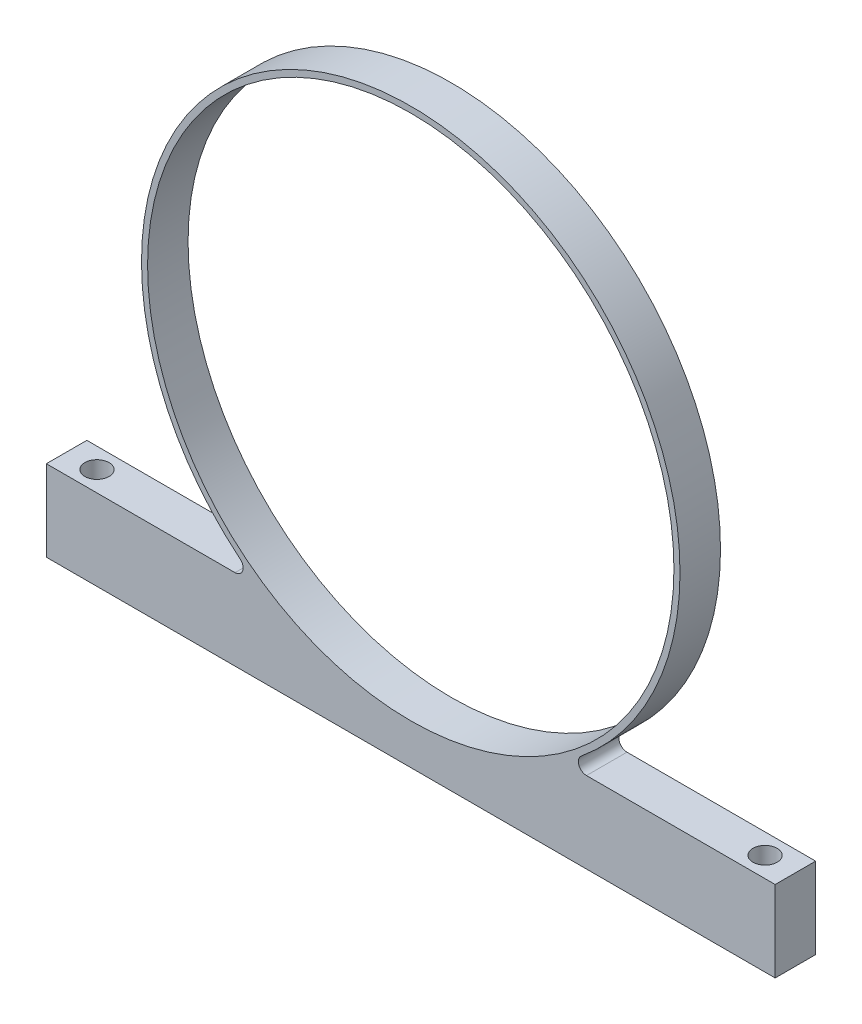
ISO-10303-21;
HEADER;
FILE_DESCRIPTION(('STEP AP214'),'2;1');
FILE_NAME('part.step','',(''),(''),'','','');
FILE_SCHEMA(('AUTOMOTIVE_DESIGN { 1 0 10303 214 1 1 1 1 }'));
ENDSEC;
DATA;
#1=APPLICATION_CONTEXT('core data for automotive mechanical design processes');
#2=APPLICATION_PROTOCOL_DEFINITION('international standard','automotive_design',2000,#1);
#3=PRODUCT_CONTEXT('',#1,'mechanical');
#4=PRODUCT('Part','Part','',(#3));
#5=PRODUCT_RELATED_PRODUCT_CATEGORY('part','',(#4));
#6=PRODUCT_DEFINITION_FORMATION('','',#4);
#7=PRODUCT_DEFINITION_CONTEXT('part definition',#1,'design');
#8=PRODUCT_DEFINITION('design','',#6,#7);
#9=PRODUCT_DEFINITION_SHAPE('','',#8);
#10=(LENGTH_UNIT() NAMED_UNIT(*) SI_UNIT(.MILLI.,.METRE.));
#11=(NAMED_UNIT(*) PLANE_ANGLE_UNIT() SI_UNIT($,.RADIAN.));
#12=(NAMED_UNIT(*) SI_UNIT($,.STERADIAN.) SOLID_ANGLE_UNIT());
#13=UNCERTAINTY_MEASURE_WITH_UNIT(LENGTH_MEASURE(1.E-05),#10,'distance_accuracy_value','');
#14=(GEOMETRIC_REPRESENTATION_CONTEXT(3) GLOBAL_UNCERTAINTY_ASSIGNED_CONTEXT((#13)) GLOBAL_UNIT_ASSIGNED_CONTEXT((#10,
#11,#12)) REPRESENTATION_CONTEXT('',''));
#15=CARTESIAN_POINT('',(0.,0.,0.));
#16=DIRECTION('',(0.,0.,1.));
#17=DIRECTION('',(1.,0.,0.));
#18=AXIS2_PLACEMENT_3D('',#15,#16,#17);
#19=CARTESIAN_POINT('',(0.,0.,6.35));
#20=DIRECTION('',(0.,0.,1.));
#21=DIRECTION('',(1.,0.,0.));
#22=AXIS2_PLACEMENT_3D('',#19,#20,#21);
#23=PLANE('',#22);
#24=DIRECTION('',(0.,-1.,0.));
#25=VECTOR('',#24,1.);
#26=CARTESIAN_POINT('',(-57.15,-34.925,6.35));
#27=LINE('',#26,#25);
#28=CARTESIAN_POINT('',(-57.15,-34.925,6.35));
#29=VERTEX_POINT('',#28);
#30=CARTESIAN_POINT('',(-57.15,-47.625,6.35));
#31=VERTEX_POINT('',#30);
#32=EDGE_CURVE('E108',#29,#31,#27,.T.);
#33=ORIENTED_EDGE('',*,*,#32,.T.);
#34=DIRECTION('',(1.,0.,0.));
#35=VECTOR('',#34,1.);
#36=CARTESIAN_POINT('',(57.15,-47.625,6.35));
#37=LINE('',#36,#35);
#38=CARTESIAN_POINT('',(57.15,-47.625,6.35));
#39=VERTEX_POINT('',#38);
#40=EDGE_CURVE('E97',#31,#39,#37,.T.);
#41=ORIENTED_EDGE('',*,*,#40,.T.);
#42=DIRECTION('',(0.,1.,0.));
#43=VECTOR('',#42,1.);
#44=CARTESIAN_POINT('',(57.15,-34.925,6.35));
#45=LINE('',#44,#43);
#46=CARTESIAN_POINT('',(57.15,-34.925,6.35));
#47=VERTEX_POINT('',#46);
#48=EDGE_CURVE('E107',#39,#47,#45,.T.);
#49=ORIENTED_EDGE('',*,*,#48,.T.);
#50=DIRECTION('',(-1.,0.,0.));
#51=VECTOR('',#50,1.);
#52=CARTESIAN_POINT('',(57.15,-34.925,6.35));
#53=LINE('',#52,#51);
#54=CARTESIAN_POINT('',(27.5567320495374,-34.925,6.35));
#55=VERTEX_POINT('',#54);
#56=EDGE_CURVE('E169',#47,#55,#53,.T.);
#57=ORIENTED_EDGE('',*,*,#56,.T.);
#58=CARTESIAN_POINT('',(27.5567320495374,-33.655,6.35));
#59=DIRECTION('',(0.,0.,1.));
#60=DIRECTION('',(1.,0.,0.));
#61=AXIS2_PLACEMENT_3D('',#58,#59,#60);
#62=CIRCLE('',#61,1.27);
#63=CARTESIAN_POINT('',(26.7521559313027,-32.6723722627737,6.35));
#64=VERTEX_POINT('',#63);
#65=EDGE_CURVE('E11',#55,#64,#62,.F.);
#66=ORIENTED_EDGE('',*,*,#65,.T.);
#67=CARTESIAN_POINT('',(0.,0.,6.35));
#68=DIRECTION('',(0.,0.,1.));
#69=DIRECTION('',(1.,0.,0.));
#70=AXIS2_PLACEMENT_3D('',#67,#68,#69);
#71=CIRCLE('',#70,42.2275);
#72=CARTESIAN_POINT('',(-26.7521559313027,-32.6723722627737,6.35));
#73=VERTEX_POINT('',#72);
#74=EDGE_CURVE('E142',#64,#73,#71,.T.);
#75=ORIENTED_EDGE('',*,*,#74,.T.);
#76=CARTESIAN_POINT('',(-27.5567320495374,-33.655,6.35));
#77=DIRECTION('',(0.,0.,1.));
#78=DIRECTION('',(1.,0.,0.));
#79=AXIS2_PLACEMENT_3D('',#76,#77,#78);
#80=CIRCLE('',#79,1.27);
#81=CARTESIAN_POINT('',(-27.5567320495374,-34.925,6.35));
#82=VERTEX_POINT('',#81);
#83=EDGE_CURVE('E138',#73,#82,#80,.F.);
#84=ORIENTED_EDGE('',*,*,#83,.T.);
#85=DIRECTION('',(-1.,0.,0.));
#86=VECTOR('',#85,1.);
#87=CARTESIAN_POINT('',(-23.7361776882884,-34.925,6.35));
#88=LINE('',#87,#86);
#89=EDGE_CURVE('E113',#82,#29,#88,.T.);
#90=ORIENTED_EDGE('',*,*,#89,.T.);
#91=EDGE_LOOP('',(#33,#41,#49,#57,#66,#75,#84,#90));
#92=FACE_BOUND('',#91,.T.);
#93=CARTESIAN_POINT('',(0.,0.,6.35));
#94=DIRECTION('',(0.,0.,1.));
#95=DIRECTION('',(1.,0.,0.));
#96=AXIS2_PLACEMENT_3D('',#93,#94,#95);
#97=CIRCLE('',#96,41.275);
#98=CARTESIAN_POINT('',(41.275,0.,6.35));
#99=VERTEX_POINT('',#98);
#100=EDGE_CURVE('E175',#99,#99,#97,.T.);
#101=ORIENTED_EDGE('',*,*,#100,.F.);
#102=EDGE_LOOP('',(#101));
#103=FACE_BOUND('',#102,.T.);
#104=ADVANCED_FACE('F32',(#92,#103),#23,.T.);
#105=CARTESIAN_POINT('',(0.,0.,0.));
#106=DIRECTION('',(0.,0.,1.));
#107=DIRECTION('',(1.,0.,0.));
#108=AXIS2_PLACEMENT_3D('',#105,#106,#107);
#109=PLANE('',#108);
#110=DIRECTION('',(0.,-1.,0.));
#111=VECTOR('',#110,1.);
#112=CARTESIAN_POINT('',(-57.15,-34.925,0.));
#113=LINE('',#112,#111);
#114=CARTESIAN_POINT('',(-57.15,-34.925,0.));
#115=VERTEX_POINT('',#114);
#116=CARTESIAN_POINT('',(-57.15,-47.625,0.));
#117=VERTEX_POINT('',#116);
#118=EDGE_CURVE('E121',#115,#117,#113,.T.);
#119=ORIENTED_EDGE('',*,*,#118,.F.);
#120=DIRECTION('',(-1.,0.,0.));
#121=VECTOR('',#120,1.);
#122=CARTESIAN_POINT('',(-23.7361776882884,-34.925,0.));
#123=LINE('',#122,#121);
#124=CARTESIAN_POINT('',(-27.5567320495374,-34.925,0.));
#125=VERTEX_POINT('',#124);
#126=EDGE_CURVE('E117',#125,#115,#123,.T.);
#127=ORIENTED_EDGE('',*,*,#126,.F.);
#128=CARTESIAN_POINT('',(-27.5567320495374,-33.655,0.));
#129=DIRECTION('',(0.,0.,1.));
#130=DIRECTION('',(1.,0.,0.));
#131=AXIS2_PLACEMENT_3D('',#128,#129,#130);
#132=CIRCLE('',#131,1.27);
#133=CARTESIAN_POINT('',(-26.7521559313027,-32.6723722627737,0.));
#134=VERTEX_POINT('',#133);
#135=EDGE_CURVE('E136',#125,#134,#132,.T.);
#136=ORIENTED_EDGE('',*,*,#135,.T.);
#137=CARTESIAN_POINT('',(0.,0.,0.));
#138=DIRECTION('',(0.,0.,1.));
#139=DIRECTION('',(1.,0.,0.));
#140=AXIS2_PLACEMENT_3D('',#137,#138,#139);
#141=CIRCLE('',#140,42.2275);
#142=CARTESIAN_POINT('',(26.7521559313027,-32.6723722627737,0.));
#143=VERTEX_POINT('',#142);
#144=EDGE_CURVE('E155',#143,#134,#141,.T.);
#145=ORIENTED_EDGE('',*,*,#144,.F.);
#146=CARTESIAN_POINT('',(27.5567320495374,-33.655,0.));
#147=DIRECTION('',(0.,0.,1.));
#148=DIRECTION('',(1.,0.,0.));
#149=AXIS2_PLACEMENT_3D('',#146,#147,#148);
#150=CIRCLE('',#149,1.27);
#151=CARTESIAN_POINT('',(27.5567320495374,-34.925,0.));
#152=VERTEX_POINT('',#151);
#153=EDGE_CURVE('E40',#143,#152,#150,.T.);
#154=ORIENTED_EDGE('',*,*,#153,.T.);
#155=DIRECTION('',(-1.,0.,0.));
#156=VECTOR('',#155,1.);
#157=CARTESIAN_POINT('',(57.15,-34.925,0.));
#158=LINE('',#157,#156);
#159=CARTESIAN_POINT('',(57.15,-34.925,0.));
#160=VERTEX_POINT('',#159);
#161=EDGE_CURVE('E159',#160,#152,#158,.T.);
#162=ORIENTED_EDGE('',*,*,#161,.F.);
#163=DIRECTION('',(0.,1.,0.));
#164=VECTOR('',#163,1.);
#165=CARTESIAN_POINT('',(57.15,-34.925,0.));
#166=LINE('',#165,#164);
#167=CARTESIAN_POINT('',(57.15,-47.625,0.));
#168=VERTEX_POINT('',#167);
#169=EDGE_CURVE('E162',#168,#160,#166,.T.);
#170=ORIENTED_EDGE('',*,*,#169,.F.);
#171=DIRECTION('',(1.,0.,0.));
#172=VECTOR('',#171,1.);
#173=CARTESIAN_POINT('',(57.15,-47.625,0.));
#174=LINE('',#173,#172);
#175=EDGE_CURVE('E172',#117,#168,#174,.T.);
#176=ORIENTED_EDGE('',*,*,#175,.F.);
#177=EDGE_LOOP('',(#119,#127,#136,#145,#154,#162,#170,#176));
#178=FACE_BOUND('',#177,.T.);
#179=CARTESIAN_POINT('',(0.,0.,0.));
#180=DIRECTION('',(0.,0.,1.));
#181=DIRECTION('',(1.,0.,0.));
#182=AXIS2_PLACEMENT_3D('',#179,#180,#181);
#183=CIRCLE('',#182,41.275);
#184=CARTESIAN_POINT('',(41.275,0.,0.));
#185=VERTEX_POINT('',#184);
#186=EDGE_CURVE('E180',#185,#185,#183,.T.);
#187=ORIENTED_EDGE('',*,*,#186,.T.);
#188=EDGE_LOOP('',(#187));
#189=FACE_BOUND('',#188,.T.);
#190=ADVANCED_FACE('F153',(#178,#189),#109,.F.);
#191=CARTESIAN_POINT('',(-57.15,-34.925,6.35));
#192=DIRECTION('',(1.,0.,0.));
#193=DIRECTION('',(0.,0.,-1.));
#194=AXIS2_PLACEMENT_3D('',#191,#192,#193);
#195=PLANE('',#194);
#196=ORIENTED_EDGE('',*,*,#118,.T.);
#197=DIRECTION('',(0.,0.,-1.));
#198=VECTOR('',#197,1.);
#199=CARTESIAN_POINT('',(-57.15,-47.625,6.35));
#200=LINE('',#199,#198);
#201=EDGE_CURVE('E101',#31,#117,#200,.T.);
#202=ORIENTED_EDGE('',*,*,#201,.F.);
#203=ORIENTED_EDGE('',*,*,#32,.F.);
#204=DIRECTION('',(0.,0.,-1.));
#205=VECTOR('',#204,1.);
#206=CARTESIAN_POINT('',(-57.15,-34.925,6.35));
#207=LINE('',#206,#205);
#208=EDGE_CURVE('E149',#29,#115,#207,.T.);
#209=ORIENTED_EDGE('',*,*,#208,.T.);
#210=EDGE_LOOP('',(#196,#202,#203,#209));
#211=FACE_BOUND('',#210,.T.);
#212=ADVANCED_FACE('F119',(#211),#195,.F.);
#213=CARTESIAN_POINT('',(57.15,-47.625,6.35));
#214=DIRECTION('',(0.,1.,0.));
#215=DIRECTION('',(-1.,0.,0.));
#216=AXIS2_PLACEMENT_3D('',#213,#214,#215);
#217=PLANE('',#216);
#218=CARTESIAN_POINT('',(-52.3875,-47.625,3.17499999999999));
#219=DIRECTION('',(0.,-1.,0.));
#220=DIRECTION('',(0.,0.,-1.));
#221=AXIS2_PLACEMENT_3D('',#218,#219,#220);
#222=CIRCLE('',#221,1.89864999999999);
#223=CARTESIAN_POINT('',(-52.3875,-47.625,1.27635));
#224=VERTEX_POINT('',#223);
#225=EDGE_CURVE('E194',#224,#224,#222,.T.);
#226=ORIENTED_EDGE('',*,*,#225,.F.);
#227=EDGE_LOOP('',(#226));
#228=FACE_BOUND('',#227,.T.);
#229=CARTESIAN_POINT('',(52.3875,-47.625,3.175));
#230=DIRECTION('',(0.,-1.,0.));
#231=DIRECTION('',(0.,0.,-1.));
#232=AXIS2_PLACEMENT_3D('',#229,#230,#231);
#233=CIRCLE('',#232,1.89864999999999);
#234=CARTESIAN_POINT('',(52.3875,-47.625,1.27635000000001));
#235=VERTEX_POINT('',#234);
#236=EDGE_CURVE('E188',#235,#235,#233,.T.);
#237=ORIENTED_EDGE('',*,*,#236,.F.);
#238=EDGE_LOOP('',(#237));
#239=FACE_BOUND('',#238,.T.);
#240=ORIENTED_EDGE('',*,*,#175,.T.);
#241=DIRECTION('',(0.,0.,-1.));
#242=VECTOR('',#241,1.);
#243=CARTESIAN_POINT('',(57.15,-47.625,6.35));
#244=LINE('',#243,#242);
#245=EDGE_CURVE('E104',#39,#168,#244,.T.);
#246=ORIENTED_EDGE('',*,*,#245,.F.);
#247=ORIENTED_EDGE('',*,*,#40,.F.);
#248=ORIENTED_EDGE('',*,*,#201,.T.);
#249=EDGE_LOOP('',(#240,#246,#247,#248));
#250=FACE_BOUND('',#249,.T.);
#251=ADVANCED_FACE('F99',(#228,#239,#250),#217,.F.);
#252=CARTESIAN_POINT('',(57.15,-34.925,6.35));
#253=DIRECTION('',(-1.,0.,0.));
#254=DIRECTION('',(0.,-1.,0.));
#255=AXIS2_PLACEMENT_3D('',#252,#253,#254);
#256=PLANE('',#255);
#257=ORIENTED_EDGE('',*,*,#169,.T.);
#258=DIRECTION('',(0.,0.,-1.));
#259=VECTOR('',#258,1.);
#260=CARTESIAN_POINT('',(57.15,-34.925,6.35));
#261=LINE('',#260,#259);
#262=EDGE_CURVE('E127',#47,#160,#261,.T.);
#263=ORIENTED_EDGE('',*,*,#262,.F.);
#264=ORIENTED_EDGE('',*,*,#48,.F.);
#265=ORIENTED_EDGE('',*,*,#245,.T.);
#266=EDGE_LOOP('',(#257,#263,#264,#265));
#267=FACE_BOUND('',#266,.T.);
#268=ADVANCED_FACE('F203',(#267),#256,.F.);
#269=CARTESIAN_POINT('',(57.15,-34.925,6.35));
#270=DIRECTION('',(0.,-1.,0.));
#271=DIRECTION('',(0.,0.,-1.));
#272=AXIS2_PLACEMENT_3D('',#269,#270,#271);
#273=PLANE('',#272);
#274=CARTESIAN_POINT('',(52.3875,-34.925,3.175));
#275=DIRECTION('',(0.,-1.,0.));
#276=DIRECTION('',(0.,0.,-1.));
#277=AXIS2_PLACEMENT_3D('',#274,#275,#276);
#278=CIRCLE('',#277,1.89864999999999);
#279=CARTESIAN_POINT('',(52.3875,-34.925,1.27635000000001));
#280=VERTEX_POINT('',#279);
#281=EDGE_CURVE('E183',#280,#280,#278,.T.);
#282=ORIENTED_EDGE('',*,*,#281,.T.);
#283=EDGE_LOOP('',(#282));
#284=FACE_BOUND('',#283,.T.);
#285=ORIENTED_EDGE('',*,*,#161,.T.);
#286=DIRECTION('',(0.,0.,1.));
#287=VECTOR('',#286,1.);
#288=CARTESIAN_POINT('',(27.5567320495374,-34.925,6.35));
#289=LINE('',#288,#287);
#290=EDGE_CURVE('E47',#152,#55,#289,.T.);
#291=ORIENTED_EDGE('',*,*,#290,.T.);
#292=ORIENTED_EDGE('',*,*,#56,.F.);
#293=ORIENTED_EDGE('',*,*,#262,.T.);
#294=EDGE_LOOP('',(#285,#291,#292,#293));
#295=FACE_BOUND('',#294,.T.);
#296=ADVANCED_FACE('F168',(#284,#295),#273,.F.);
#297=CARTESIAN_POINT('',(0.,0.,6.35));
#298=DIRECTION('',(0.,0.,-1.));
#299=DIRECTION('',(-1.,0.,0.));
#300=AXIS2_PLACEMENT_3D('',#297,#298,#299);
#301=CYLINDRICAL_SURFACE('',#300,42.2275);
#302=ORIENTED_EDGE('',*,*,#144,.T.);
#303=DIRECTION('',(0.,0.,-1.));
#304=VECTOR('',#303,1.);
#305=CARTESIAN_POINT('',(-26.7521559313027,-32.6723722627737,6.35));
#306=LINE('',#305,#304);
#307=EDGE_CURVE('E133',#134,#73,#306,.F.);
#308=ORIENTED_EDGE('',*,*,#307,.T.);
#309=ORIENTED_EDGE('',*,*,#74,.F.);
#310=DIRECTION('',(0.,0.,-1.));
#311=VECTOR('',#310,1.);
#312=CARTESIAN_POINT('',(26.7521559313027,-32.6723722627737,6.35));
#313=LINE('',#312,#311);
#314=EDGE_CURVE('E125',#64,#143,#313,.T.);
#315=ORIENTED_EDGE('',*,*,#314,.T.);
#316=EDGE_LOOP('',(#302,#308,#309,#315));
#317=FACE_BOUND('',#316,.T.);
#318=ADVANCED_FACE('F157',(#317),#301,.T.);
#319=CARTESIAN_POINT('',(-23.7361776882884,-34.925,6.35));
#320=DIRECTION('',(0.,-1.,0.));
#321=DIRECTION('',(1.,0.,0.));
#322=AXIS2_PLACEMENT_3D('',#319,#320,#321);
#323=PLANE('',#322);
#324=CARTESIAN_POINT('',(-52.3875,-34.925,3.17499999999999));
#325=DIRECTION('',(0.,-1.,0.));
#326=DIRECTION('',(1.,0.,0.));
#327=AXIS2_PLACEMENT_3D('',#324,#325,#326);
#328=CIRCLE('',#327,1.89864999999999);
#329=CARTESIAN_POINT('',(-50.48885,-34.925,3.17499999999999));
#330=VERTEX_POINT('',#329);
#331=EDGE_CURVE('E191',#330,#330,#328,.T.);
#332=ORIENTED_EDGE('',*,*,#331,.T.);
#333=EDGE_LOOP('',(#332));
#334=FACE_BOUND('',#333,.T.);
#335=ORIENTED_EDGE('',*,*,#89,.F.);
#336=DIRECTION('',(0.,0.,1.));
#337=VECTOR('',#336,1.);
#338=CARTESIAN_POINT('',(-27.5567320495374,-34.925,0.));
#339=LINE('',#338,#337);
#340=EDGE_CURVE('E122',#82,#125,#339,.F.);
#341=ORIENTED_EDGE('',*,*,#340,.T.);
#342=ORIENTED_EDGE('',*,*,#126,.T.);
#343=ORIENTED_EDGE('',*,*,#208,.F.);
#344=EDGE_LOOP('',(#335,#341,#342,#343));
#345=FACE_BOUND('',#344,.T.);
#346=ADVANCED_FACE('F147',(#334,#345),#323,.F.);
#347=CARTESIAN_POINT('',(0.,0.,6.35));
#348=DIRECTION('',(0.,0.,-1.));
#349=DIRECTION('',(-1.,0.,0.));
#350=AXIS2_PLACEMENT_3D('',#347,#348,#349);
#351=CYLINDRICAL_SURFACE('',#350,41.275);
#352=ORIENTED_EDGE('',*,*,#100,.T.);
#353=EDGE_LOOP('',(#352));
#354=FACE_BOUND('',#353,.T.);
#355=ORIENTED_EDGE('',*,*,#186,.F.);
#356=EDGE_LOOP('',(#355));
#357=FACE_BOUND('',#356,.T.);
#358=ADVANCED_FACE('F228',(#354,#357),#351,.F.);
#359=CARTESIAN_POINT('',(-27.5567320495374,-33.655,6.35));
#360=DIRECTION('',(0.,0.,-1.));
#361=DIRECTION('',(-1.,0.,0.));
#362=AXIS2_PLACEMENT_3D('',#359,#360,#361);
#363=CYLINDRICAL_SURFACE('',#362,1.27);
#364=ORIENTED_EDGE('',*,*,#83,.F.);
#365=ORIENTED_EDGE('',*,*,#307,.F.);
#366=ORIENTED_EDGE('',*,*,#135,.F.);
#367=ORIENTED_EDGE('',*,*,#340,.F.);
#368=EDGE_LOOP('',(#364,#365,#366,#367));
#369=FACE_BOUND('',#368,.T.);
#370=ADVANCED_FACE('F151',(#369),#363,.F.);
#371=CARTESIAN_POINT('',(27.5567320495374,-33.655,6.35));
#372=DIRECTION('',(0.,0.,-1.));
#373=DIRECTION('',(-1.,0.,0.));
#374=AXIS2_PLACEMENT_3D('',#371,#372,#373);
#375=CYLINDRICAL_SURFACE('',#374,1.27);
#376=ORIENTED_EDGE('',*,*,#65,.F.);
#377=ORIENTED_EDGE('',*,*,#290,.F.);
#378=ORIENTED_EDGE('',*,*,#153,.F.);
#379=ORIENTED_EDGE('',*,*,#314,.F.);
#380=EDGE_LOOP('',(#376,#377,#378,#379));
#381=FACE_BOUND('',#380,.T.);
#382=ADVANCED_FACE('F34',(#381),#375,.F.);
#383=CARTESIAN_POINT('',(52.3875,-47.625,3.175));
#384=DIRECTION('',(0.,-1.,0.));
#385=DIRECTION('',(0.,0.,-1.));
#386=AXIS2_PLACEMENT_3D('',#383,#384,#385);
#387=CYLINDRICAL_SURFACE('',#386,1.89864999999999);
#388=ORIENTED_EDGE('',*,*,#236,.T.);
#389=EDGE_LOOP('',(#388));
#390=FACE_BOUND('',#389,.T.);
#391=ORIENTED_EDGE('',*,*,#281,.F.);
#392=EDGE_LOOP('',(#391));
#393=FACE_BOUND('',#392,.T.);
#394=ADVANCED_FACE('F207',(#390,#393),#387,.F.);
#395=CARTESIAN_POINT('',(-52.3875,-47.625,3.17499999999999));
#396=DIRECTION('',(0.,-1.,0.));
#397=DIRECTION('',(0.,0.,-1.));
#398=AXIS2_PLACEMENT_3D('',#395,#396,#397);
#399=CYLINDRICAL_SURFACE('',#398,1.89864999999999);
#400=ORIENTED_EDGE('',*,*,#225,.T.);
#401=EDGE_LOOP('',(#400));
#402=FACE_BOUND('',#401,.T.);
#403=ORIENTED_EDGE('',*,*,#331,.F.);
#404=EDGE_LOOP('',(#403));
#405=FACE_BOUND('',#404,.T.);
#406=ADVANCED_FACE('F198',(#402,#405),#399,.F.);
#407=CLOSED_SHELL('',(#104,#190,#212,#251,#268,#296,#318,#346,#358,#370,#382,#394,#406));
#408=MANIFOLD_SOLID_BREP('B2',#407);
#409=ADVANCED_BREP_SHAPE_REPRESENTATION('',(#18,#408),#14);
#410=SHAPE_DEFINITION_REPRESENTATION(#9,#409);
ENDSEC;
END-ISO-10303-21;
